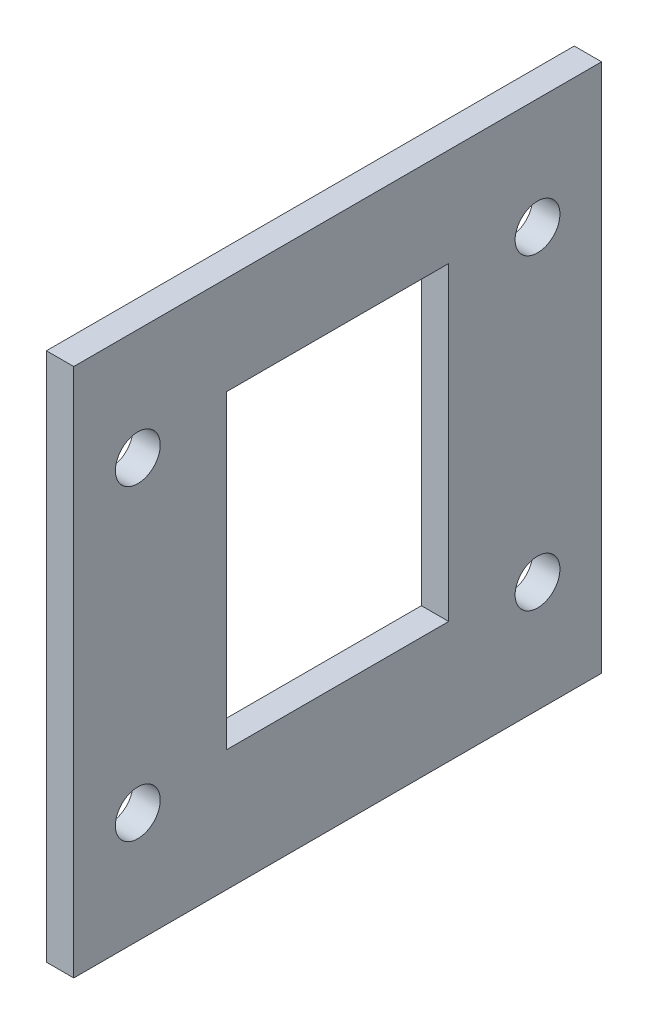
ISO-10303-21;
HEADER;
FILE_DESCRIPTION(('STEP AP214'),'2;1');
FILE_NAME('part.step','',(''),(''),'','','');
FILE_SCHEMA(('AUTOMOTIVE_DESIGN { 1 0 10303 214 1 1 1 1 }'));
ENDSEC;
DATA;
#1=APPLICATION_CONTEXT('core data for automotive mechanical design processes');
#2=APPLICATION_PROTOCOL_DEFINITION('international standard','automotive_design',2000,#1);
#3=PRODUCT_CONTEXT('',#1,'mechanical');
#4=PRODUCT('Part','Part','',(#3));
#5=PRODUCT_RELATED_PRODUCT_CATEGORY('part','',(#4));
#6=PRODUCT_DEFINITION_FORMATION('','',#4);
#7=PRODUCT_DEFINITION_CONTEXT('part definition',#1,'design');
#8=PRODUCT_DEFINITION('design','',#6,#7);
#9=PRODUCT_DEFINITION_SHAPE('','',#8);
#10=(LENGTH_UNIT() NAMED_UNIT(*) SI_UNIT(.MILLI.,.METRE.));
#11=(NAMED_UNIT(*) PLANE_ANGLE_UNIT() SI_UNIT($,.RADIAN.));
#12=(NAMED_UNIT(*) SI_UNIT($,.STERADIAN.) SOLID_ANGLE_UNIT());
#13=UNCERTAINTY_MEASURE_WITH_UNIT(LENGTH_MEASURE(1.E-05),#10,'distance_accuracy_value','');
#14=(GEOMETRIC_REPRESENTATION_CONTEXT(3) GLOBAL_UNCERTAINTY_ASSIGNED_CONTEXT((#13)) GLOBAL_UNIT_ASSIGNED_CONTEXT((#10,
#11,#12)) REPRESENTATION_CONTEXT('',''));
#15=CARTESIAN_POINT('',(0.,0.,0.));
#16=DIRECTION('',(0.,0.,1.));
#17=DIRECTION('',(1.,0.,0.));
#18=AXIS2_PLACEMENT_3D('',#15,#16,#17);
#19=CARTESIAN_POINT('',(3.2,0.,0.));
#20=DIRECTION('',(0.,0.,-1.));
#21=DIRECTION('',(-1.,0.,0.));
#22=AXIS2_PLACEMENT_3D('',#19,#20,#21);
#23=PLANE('',#22);
#24=DIRECTION('',(0.,-1.,0.));
#25=VECTOR('',#24,1.);
#26=CARTESIAN_POINT('',(0.,0.,0.));
#27=LINE('',#26,#25);
#28=CARTESIAN_POINT('',(0.,62.,0.));
#29=VERTEX_POINT('',#28);
#30=CARTESIAN_POINT('',(0.,0.,0.));
#31=VERTEX_POINT('',#30);
#32=EDGE_CURVE('E103',#29,#31,#27,.T.);
#33=ORIENTED_EDGE('',*,*,#32,.T.);
#34=DIRECTION('',(-1.,0.,0.));
#35=VECTOR('',#34,1.);
#36=CARTESIAN_POINT('',(3.2,0.,0.));
#37=LINE('',#36,#35);
#38=CARTESIAN_POINT('',(3.2,0.,0.));
#39=VERTEX_POINT('',#38);
#40=EDGE_CURVE('E11',#39,#31,#37,.T.);
#41=ORIENTED_EDGE('',*,*,#40,.F.);
#42=DIRECTION('',(0.,-1.,0.));
#43=VECTOR('',#42,1.);
#44=CARTESIAN_POINT('',(3.2,0.,0.));
#45=LINE('',#44,#43);
#46=CARTESIAN_POINT('',(3.2,62.,0.));
#47=VERTEX_POINT('',#46);
#48=EDGE_CURVE('E132',#47,#39,#45,.T.);
#49=ORIENTED_EDGE('',*,*,#48,.F.);
#50=DIRECTION('',(-1.,0.,0.));
#51=VECTOR('',#50,1.);
#52=CARTESIAN_POINT('',(3.2,62.,0.));
#53=LINE('',#52,#51);
#54=EDGE_CURVE('E142',#47,#29,#53,.T.);
#55=ORIENTED_EDGE('',*,*,#54,.T.);
#56=EDGE_LOOP('',(#33,#41,#49,#55));
#57=FACE_BOUND('',#56,.T.);
#58=ADVANCED_FACE('F33',(#57),#23,.F.);
#59=CARTESIAN_POINT('',(3.2,0.,0.));
#60=DIRECTION('',(0.,1.,0.));
#61=DIRECTION('',(0.,0.,1.));
#62=AXIS2_PLACEMENT_3D('',#59,#60,#61);
#63=PLANE('',#62);
#64=DIRECTION('',(0.,0.,-1.));
#65=VECTOR('',#64,1.);
#66=CARTESIAN_POINT('',(0.,0.,0.));
#67=LINE('',#66,#65);
#68=CARTESIAN_POINT('',(0.,0.,-61.8));
#69=VERTEX_POINT('',#68);
#70=EDGE_CURVE('E145',#31,#69,#67,.T.);
#71=ORIENTED_EDGE('',*,*,#70,.T.);
#72=DIRECTION('',(-1.,0.,0.));
#73=VECTOR('',#72,1.);
#74=CARTESIAN_POINT('',(3.2,0.,-61.8));
#75=LINE('',#74,#73);
#76=CARTESIAN_POINT('',(3.2,0.,-61.8));
#77=VERTEX_POINT('',#76);
#78=EDGE_CURVE('E40',#77,#69,#75,.T.);
#79=ORIENTED_EDGE('',*,*,#78,.F.);
#80=DIRECTION('',(0.,0.,-1.));
#81=VECTOR('',#80,1.);
#82=CARTESIAN_POINT('',(3.2,0.,0.));
#83=LINE('',#82,#81);
#84=EDGE_CURVE('E135',#39,#77,#83,.T.);
#85=ORIENTED_EDGE('',*,*,#84,.F.);
#86=ORIENTED_EDGE('',*,*,#40,.T.);
#87=EDGE_LOOP('',(#71,#79,#85,#86));
#88=FACE_BOUND('',#87,.T.);
#89=ADVANCED_FACE('F173',(#88),#63,.F.);
#90=CARTESIAN_POINT('',(3.2,0.,-61.8));
#91=DIRECTION('',(0.,0.,1.));
#92=DIRECTION('',(1.,0.,0.));
#93=AXIS2_PLACEMENT_3D('',#90,#91,#92);
#94=PLANE('',#93);
#95=DIRECTION('',(0.,1.,0.));
#96=VECTOR('',#95,1.);
#97=CARTESIAN_POINT('',(0.,0.,-61.8));
#98=LINE('',#97,#96);
#99=CARTESIAN_POINT('',(0.,62.,-61.8));
#100=VERTEX_POINT('',#99);
#101=EDGE_CURVE('E147',#69,#100,#98,.T.);
#102=ORIENTED_EDGE('',*,*,#101,.T.);
#103=DIRECTION('',(-1.,0.,0.));
#104=VECTOR('',#103,1.);
#105=CARTESIAN_POINT('',(3.2,62.,-61.8));
#106=LINE('',#105,#104);
#107=CARTESIAN_POINT('',(3.2,62.,-61.8));
#108=VERTEX_POINT('',#107);
#109=EDGE_CURVE('E152',#108,#100,#106,.T.);
#110=ORIENTED_EDGE('',*,*,#109,.F.);
#111=DIRECTION('',(0.,1.,0.));
#112=VECTOR('',#111,1.);
#113=CARTESIAN_POINT('',(3.2,0.,-61.8));
#114=LINE('',#113,#112);
#115=EDGE_CURVE('E138',#77,#108,#114,.T.);
#116=ORIENTED_EDGE('',*,*,#115,.F.);
#117=ORIENTED_EDGE('',*,*,#78,.T.);
#118=EDGE_LOOP('',(#102,#110,#116,#117));
#119=FACE_BOUND('',#118,.T.);
#120=ADVANCED_FACE('F159',(#119),#94,.F.);
#121=CARTESIAN_POINT('',(3.2,62.,0.));
#122=DIRECTION('',(0.,-1.,0.));
#123=DIRECTION('',(0.,0.,-1.));
#124=AXIS2_PLACEMENT_3D('',#121,#122,#123);
#125=PLANE('',#124);
#126=DIRECTION('',(0.,0.,1.));
#127=VECTOR('',#126,1.);
#128=CARTESIAN_POINT('',(0.,62.,0.));
#129=LINE('',#128,#127);
#130=EDGE_CURVE('E136',#100,#29,#129,.T.);
#131=ORIENTED_EDGE('',*,*,#130,.T.);
#132=ORIENTED_EDGE('',*,*,#54,.F.);
#133=DIRECTION('',(0.,0.,1.));
#134=VECTOR('',#133,1.);
#135=CARTESIAN_POINT('',(3.2,62.,0.));
#136=LINE('',#135,#134);
#137=EDGE_CURVE('E140',#108,#47,#136,.T.);
#138=ORIENTED_EDGE('',*,*,#137,.F.);
#139=ORIENTED_EDGE('',*,*,#109,.T.);
#140=EDGE_LOOP('',(#131,#132,#138,#139));
#141=FACE_BOUND('',#140,.T.);
#142=ADVANCED_FACE('F166',(#141),#125,.F.);
#143=CARTESIAN_POINT('',(3.2,0.,0.));
#144=DIRECTION('',(-1.,0.,0.));
#145=DIRECTION('',(0.,0.,1.));
#146=AXIS2_PLACEMENT_3D('',#143,#144,#145);
#147=PLANE('',#146);
#148=CARTESIAN_POINT('',(3.2,13.0000000000005,-54.3000000000008));
#149=DIRECTION('',(-1.,0.,0.));
#150=DIRECTION('',(0.,0.,1.));
#151=AXIS2_PLACEMENT_3D('',#148,#149,#150);
#152=CIRCLE('',#151,2.62499999999999);
#153=CARTESIAN_POINT('',(3.2,13.0000000000005,-51.6750000000008));
#154=VERTEX_POINT('',#153);
#155=EDGE_CURVE('E224',#154,#154,#152,.F.);
#156=ORIENTED_EDGE('',*,*,#155,.F.);
#157=EDGE_LOOP('',(#156));
#158=FACE_BOUND('',#157,.T.);
#159=CARTESIAN_POINT('',(3.2,49.0000000000005,-54.3000000000008));
#160=DIRECTION('',(-1.,0.,0.));
#161=DIRECTION('',(0.,0.,1.));
#162=AXIS2_PLACEMENT_3D('',#159,#160,#161);
#163=CIRCLE('',#162,2.62499999999999);
#164=CARTESIAN_POINT('',(3.2,49.0000000000005,-51.6750000000008));
#165=VERTEX_POINT('',#164);
#166=EDGE_CURVE('E228',#165,#165,#163,.F.);
#167=ORIENTED_EDGE('',*,*,#166,.F.);
#168=EDGE_LOOP('',(#167));
#169=FACE_BOUND('',#168,.T.);
#170=CARTESIAN_POINT('',(3.2,13.0000000000017,-7.50000000000057));
#171=DIRECTION('',(-1.,0.,0.));
#172=DIRECTION('',(0.,0.,1.));
#173=AXIS2_PLACEMENT_3D('',#170,#171,#172);
#174=CIRCLE('',#173,2.62500000000023);
#175=CARTESIAN_POINT('',(3.2,13.0000000000017,-4.87500000000034));
#176=VERTEX_POINT('',#175);
#177=EDGE_CURVE('E237',#176,#176,#174,.F.);
#178=ORIENTED_EDGE('',*,*,#177,.F.);
#179=EDGE_LOOP('',(#178));
#180=FACE_BOUND('',#179,.T.);
#181=CARTESIAN_POINT('',(3.2,49.0000000000018,-7.50000000000066));
#182=DIRECTION('',(-1.,0.,0.));
#183=DIRECTION('',(0.,0.,1.));
#184=AXIS2_PLACEMENT_3D('',#181,#182,#183);
#185=CIRCLE('',#184,2.62499999999999);
#186=CARTESIAN_POINT('',(3.2,49.0000000000018,-4.87500000000067));
#187=VERTEX_POINT('',#186);
#188=EDGE_CURVE('E243',#187,#187,#185,.F.);
#189=ORIENTED_EDGE('',*,*,#188,.F.);
#190=EDGE_LOOP('',(#189));
#191=FACE_BOUND('',#190,.T.);
#192=DIRECTION('',(0.,0.,1.));
#193=VECTOR('',#192,1.);
#194=CARTESIAN_POINT('',(3.2,50.5,-17.9));
#195=LINE('',#194,#193);
#196=CARTESIAN_POINT('',(3.2,50.5,-43.9));
#197=VERTEX_POINT('',#196);
#198=CARTESIAN_POINT('',(3.2,50.5,-17.9));
#199=VERTEX_POINT('',#198);
#200=EDGE_CURVE('E116',#197,#199,#195,.T.);
#201=ORIENTED_EDGE('',*,*,#200,.F.);
#202=DIRECTION('',(0.,1.,0.));
#203=VECTOR('',#202,1.);
#204=CARTESIAN_POINT('',(3.2,14.2,-43.9));
#205=LINE('',#204,#203);
#206=CARTESIAN_POINT('',(3.2,14.2,-43.9));
#207=VERTEX_POINT('',#206);
#208=EDGE_CURVE('E47',#207,#197,#205,.T.);
#209=ORIENTED_EDGE('',*,*,#208,.F.);
#210=DIRECTION('',(0.,0.,-1.));
#211=VECTOR('',#210,1.);
#212=CARTESIAN_POINT('',(3.2,14.2,-17.9));
#213=LINE('',#212,#211);
#214=CARTESIAN_POINT('',(3.2,14.2,-17.9));
#215=VERTEX_POINT('',#214);
#216=EDGE_CURVE('E109',#215,#207,#213,.T.);
#217=ORIENTED_EDGE('',*,*,#216,.F.);
#218=DIRECTION('',(0.,-1.,0.));
#219=VECTOR('',#218,1.);
#220=CARTESIAN_POINT('',(3.2,14.2,-17.9));
#221=LINE('',#220,#219);
#222=EDGE_CURVE('E123',#199,#215,#221,.T.);
#223=ORIENTED_EDGE('',*,*,#222,.F.);
#224=EDGE_LOOP('',(#201,#209,#217,#223));
#225=FACE_BOUND('',#224,.T.);
#226=ORIENTED_EDGE('',*,*,#48,.T.);
#227=ORIENTED_EDGE('',*,*,#84,.T.);
#228=ORIENTED_EDGE('',*,*,#115,.T.);
#229=ORIENTED_EDGE('',*,*,#137,.T.);
#230=EDGE_LOOP('',(#226,#227,#228,#229));
#231=FACE_BOUND('',#230,.T.);
#232=ADVANCED_FACE('F172',(#158,#169,#180,#191,#225,#231),#147,.F.);
#233=CARTESIAN_POINT('',(0.,0.,0.));
#234=DIRECTION('',(-1.,0.,0.));
#235=DIRECTION('',(0.,0.,1.));
#236=AXIS2_PLACEMENT_3D('',#233,#234,#235);
#237=PLANE('',#236);
#238=CARTESIAN_POINT('',(0.,13.0000000000005,-54.3000000000008));
#239=DIRECTION('',(-1.,0.,0.));
#240=DIRECTION('',(0.,0.,1.));
#241=AXIS2_PLACEMENT_3D('',#238,#239,#240);
#242=CIRCLE('',#241,2.62499999999999);
#243=CARTESIAN_POINT('',(0.,13.0000000000005,-51.6750000000008));
#244=VERTEX_POINT('',#243);
#245=EDGE_CURVE('E221',#244,#244,#242,.T.);
#246=ORIENTED_EDGE('',*,*,#245,.F.);
#247=EDGE_LOOP('',(#246));
#248=FACE_BOUND('',#247,.T.);
#249=CARTESIAN_POINT('',(0.,49.0000000000005,-54.3000000000008));
#250=DIRECTION('',(-1.,0.,0.));
#251=DIRECTION('',(0.,0.,1.));
#252=AXIS2_PLACEMENT_3D('',#249,#250,#251);
#253=CIRCLE('',#252,2.62499999999999);
#254=CARTESIAN_POINT('',(0.,49.0000000000005,-51.6750000000008));
#255=VERTEX_POINT('',#254);
#256=EDGE_CURVE('E225',#255,#255,#253,.T.);
#257=ORIENTED_EDGE('',*,*,#256,.F.);
#258=EDGE_LOOP('',(#257));
#259=FACE_BOUND('',#258,.T.);
#260=CARTESIAN_POINT('',(0.,13.0000000000017,-7.50000000000057));
#261=DIRECTION('',(-1.,0.,0.));
#262=DIRECTION('',(0.,0.,1.));
#263=AXIS2_PLACEMENT_3D('',#260,#261,#262);
#264=CIRCLE('',#263,2.62500000000023);
#265=CARTESIAN_POINT('',(0.,13.0000000000017,-4.87500000000034));
#266=VERTEX_POINT('',#265);
#267=EDGE_CURVE('E234',#266,#266,#264,.T.);
#268=ORIENTED_EDGE('',*,*,#267,.F.);
#269=EDGE_LOOP('',(#268));
#270=FACE_BOUND('',#269,.T.);
#271=CARTESIAN_POINT('',(0.,49.0000000000018,-7.50000000000066));
#272=DIRECTION('',(-1.,0.,0.));
#273=DIRECTION('',(0.,0.,1.));
#274=AXIS2_PLACEMENT_3D('',#271,#272,#273);
#275=CIRCLE('',#274,2.62499999999999);
#276=CARTESIAN_POINT('',(0.,49.0000000000018,-4.87500000000067));
#277=VERTEX_POINT('',#276);
#278=EDGE_CURVE('E240',#277,#277,#275,.T.);
#279=ORIENTED_EDGE('',*,*,#278,.F.);
#280=EDGE_LOOP('',(#279));
#281=FACE_BOUND('',#280,.T.);
#282=DIRECTION('',(0.,1.,0.));
#283=VECTOR('',#282,1.);
#284=CARTESIAN_POINT('',(0.,14.2,-43.9));
#285=LINE('',#284,#283);
#286=CARTESIAN_POINT('',(0.,14.2,-43.9));
#287=VERTEX_POINT('',#286);
#288=CARTESIAN_POINT('',(0.,50.5,-43.9));
#289=VERTEX_POINT('',#288);
#290=EDGE_CURVE('E107',#287,#289,#285,.T.);
#291=ORIENTED_EDGE('',*,*,#290,.T.);
#292=DIRECTION('',(0.,0.,1.));
#293=VECTOR('',#292,1.);
#294=CARTESIAN_POINT('',(0.,50.5,-17.9));
#295=LINE('',#294,#293);
#296=CARTESIAN_POINT('',(0.,50.5,-17.9));
#297=VERTEX_POINT('',#296);
#298=EDGE_CURVE('E96',#289,#297,#295,.T.);
#299=ORIENTED_EDGE('',*,*,#298,.T.);
#300=DIRECTION('',(0.,-1.,0.));
#301=VECTOR('',#300,1.);
#302=CARTESIAN_POINT('',(0.,14.2,-17.9));
#303=LINE('',#302,#301);
#304=CARTESIAN_POINT('',(0.,14.2,-17.9));
#305=VERTEX_POINT('',#304);
#306=EDGE_CURVE('E118',#297,#305,#303,.T.);
#307=ORIENTED_EDGE('',*,*,#306,.T.);
#308=DIRECTION('',(0.,0.,-1.));
#309=VECTOR('',#308,1.);
#310=CARTESIAN_POINT('',(0.,14.2,-17.9));
#311=LINE('',#310,#309);
#312=EDGE_CURVE('E114',#305,#287,#311,.T.);
#313=ORIENTED_EDGE('',*,*,#312,.T.);
#314=EDGE_LOOP('',(#291,#299,#307,#313));
#315=FACE_BOUND('',#314,.T.);
#316=ORIENTED_EDGE('',*,*,#32,.F.);
#317=ORIENTED_EDGE('',*,*,#130,.F.);
#318=ORIENTED_EDGE('',*,*,#101,.F.);
#319=ORIENTED_EDGE('',*,*,#70,.F.);
#320=EDGE_LOOP('',(#316,#317,#318,#319));
#321=FACE_BOUND('',#320,.T.);
#322=ADVANCED_FACE('F112',(#248,#259,#270,#281,#315,#321),#237,.T.);
#323=CARTESIAN_POINT('',(-0.00100000000000013,14.2,-43.9));
#324=DIRECTION('',(0.,0.,-1.));
#325=DIRECTION('',(-1.,0.,0.));
#326=AXIS2_PLACEMENT_3D('',#323,#324,#325);
#327=PLANE('',#326);
#328=DIRECTION('',(1.,0.,0.));
#329=VECTOR('',#328,1.);
#330=CARTESIAN_POINT('',(-0.00100000000000013,14.2,-43.9));
#331=LINE('',#330,#329);
#332=EDGE_CURVE('E104',#287,#207,#331,.T.);
#333=ORIENTED_EDGE('',*,*,#332,.T.);
#334=ORIENTED_EDGE('',*,*,#208,.T.);
#335=DIRECTION('',(1.,0.,0.));
#336=VECTOR('',#335,1.);
#337=CARTESIAN_POINT('',(-0.00100000000000013,50.5,-43.9));
#338=LINE('',#337,#336);
#339=EDGE_CURVE('E98',#289,#197,#338,.T.);
#340=ORIENTED_EDGE('',*,*,#339,.F.);
#341=ORIENTED_EDGE('',*,*,#290,.F.);
#342=EDGE_LOOP('',(#333,#334,#340,#341));
#343=FACE_BOUND('',#342,.T.);
#344=ADVANCED_FACE('F106',(#343),#327,.F.);
#345=CARTESIAN_POINT('',(-0.00100000000000013,14.2,-17.9));
#346=DIRECTION('',(0.,-1.,0.));
#347=DIRECTION('',(0.,0.,-1.));
#348=AXIS2_PLACEMENT_3D('',#345,#346,#347);
#349=PLANE('',#348);
#350=DIRECTION('',(1.,0.,0.));
#351=VECTOR('',#350,1.);
#352=CARTESIAN_POINT('',(-0.00100000000000013,14.2,-17.9));
#353=LINE('',#352,#351);
#354=EDGE_CURVE('E129',#305,#215,#353,.T.);
#355=ORIENTED_EDGE('',*,*,#354,.T.);
#356=ORIENTED_EDGE('',*,*,#216,.T.);
#357=ORIENTED_EDGE('',*,*,#332,.F.);
#358=ORIENTED_EDGE('',*,*,#312,.F.);
#359=EDGE_LOOP('',(#355,#356,#357,#358));
#360=FACE_BOUND('',#359,.T.);
#361=ADVANCED_FACE('F191',(#360),#349,.F.);
#362=CARTESIAN_POINT('',(-0.00100000000000013,14.2,-17.9));
#363=DIRECTION('',(0.,0.,1.));
#364=DIRECTION('',(1.,0.,0.));
#365=AXIS2_PLACEMENT_3D('',#362,#363,#364);
#366=PLANE('',#365);
#367=DIRECTION('',(1.,0.,0.));
#368=VECTOR('',#367,1.);
#369=CARTESIAN_POINT('',(-0.00100000000000013,50.5,-17.9));
#370=LINE('',#369,#368);
#371=EDGE_CURVE('E55',#297,#199,#370,.T.);
#372=ORIENTED_EDGE('',*,*,#371,.T.);
#373=ORIENTED_EDGE('',*,*,#222,.T.);
#374=ORIENTED_EDGE('',*,*,#354,.F.);
#375=ORIENTED_EDGE('',*,*,#306,.F.);
#376=EDGE_LOOP('',(#372,#373,#374,#375));
#377=FACE_BOUND('',#376,.T.);
#378=ADVANCED_FACE('F195',(#377),#366,.F.);
#379=CARTESIAN_POINT('',(-0.00100000000000013,50.5,-17.9));
#380=DIRECTION('',(0.,1.,0.));
#381=DIRECTION('',(0.,0.,1.));
#382=AXIS2_PLACEMENT_3D('',#379,#380,#381);
#383=PLANE('',#382);
#384=ORIENTED_EDGE('',*,*,#339,.T.);
#385=ORIENTED_EDGE('',*,*,#200,.T.);
#386=ORIENTED_EDGE('',*,*,#371,.F.);
#387=ORIENTED_EDGE('',*,*,#298,.F.);
#388=EDGE_LOOP('',(#384,#385,#386,#387));
#389=FACE_BOUND('',#388,.T.);
#390=ADVANCED_FACE('F97',(#389),#383,.F.);
#391=CARTESIAN_POINT('',(3.201,49.0000000000018,-7.50000000000066));
#392=DIRECTION('',(-1.,0.,0.));
#393=DIRECTION('',(0.,0.,1.));
#394=AXIS2_PLACEMENT_3D('',#391,#392,#393);
#395=CYLINDRICAL_SURFACE('',#394,2.62499999999999);
#396=ORIENTED_EDGE('',*,*,#278,.T.);
#397=EDGE_LOOP('',(#396));
#398=FACE_BOUND('',#397,.T.);
#399=ORIENTED_EDGE('',*,*,#188,.T.);
#400=EDGE_LOOP('',(#399));
#401=FACE_BOUND('',#400,.T.);
#402=ADVANCED_FACE('F194',(#398,#401),#395,.F.);
#403=CARTESIAN_POINT('',(3.201,13.0000000000017,-7.50000000000057));
#404=DIRECTION('',(-1.,0.,0.));
#405=DIRECTION('',(0.,0.,1.));
#406=AXIS2_PLACEMENT_3D('',#403,#404,#405);
#407=CYLINDRICAL_SURFACE('',#406,2.62500000000023);
#408=ORIENTED_EDGE('',*,*,#267,.T.);
#409=EDGE_LOOP('',(#408));
#410=FACE_BOUND('',#409,.T.);
#411=ORIENTED_EDGE('',*,*,#177,.T.);
#412=EDGE_LOOP('',(#411));
#413=FACE_BOUND('',#412,.T.);
#414=ADVANCED_FACE('F204',(#410,#413),#407,.F.);
#415=CARTESIAN_POINT('',(3.201,49.0000000000005,-54.3000000000008));
#416=DIRECTION('',(-1.,0.,0.));
#417=DIRECTION('',(0.,0.,1.));
#418=AXIS2_PLACEMENT_3D('',#415,#416,#417);
#419=CYLINDRICAL_SURFACE('',#418,2.62499999999999);
#420=ORIENTED_EDGE('',*,*,#256,.T.);
#421=EDGE_LOOP('',(#420));
#422=FACE_BOUND('',#421,.T.);
#423=ORIENTED_EDGE('',*,*,#166,.T.);
#424=EDGE_LOOP('',(#423));
#425=FACE_BOUND('',#424,.T.);
#426=ADVANCED_FACE('F208',(#422,#425),#419,.F.);
#427=CARTESIAN_POINT('',(3.201,13.0000000000005,-54.3000000000008));
#428=DIRECTION('',(-1.,0.,0.));
#429=DIRECTION('',(0.,0.,1.));
#430=AXIS2_PLACEMENT_3D('',#427,#428,#429);
#431=CYLINDRICAL_SURFACE('',#430,2.62499999999999);
#432=ORIENTED_EDGE('',*,*,#245,.T.);
#433=EDGE_LOOP('',(#432));
#434=FACE_BOUND('',#433,.T.);
#435=ORIENTED_EDGE('',*,*,#155,.T.);
#436=EDGE_LOOP('',(#435));
#437=FACE_BOUND('',#436,.T.);
#438=ADVANCED_FACE('F212',(#434,#437),#431,.F.);
#439=CLOSED_SHELL('',(#58,#89,#120,#142,#232,#322,#344,#361,#378,#390,#402,#414,#426,#438));
#440=MANIFOLD_SOLID_BREP('B2',#439);
#441=ADVANCED_BREP_SHAPE_REPRESENTATION('',(#18,#440),#14);
#442=SHAPE_DEFINITION_REPRESENTATION(#9,#441);
ENDSEC;
END-ISO-10303-21;
